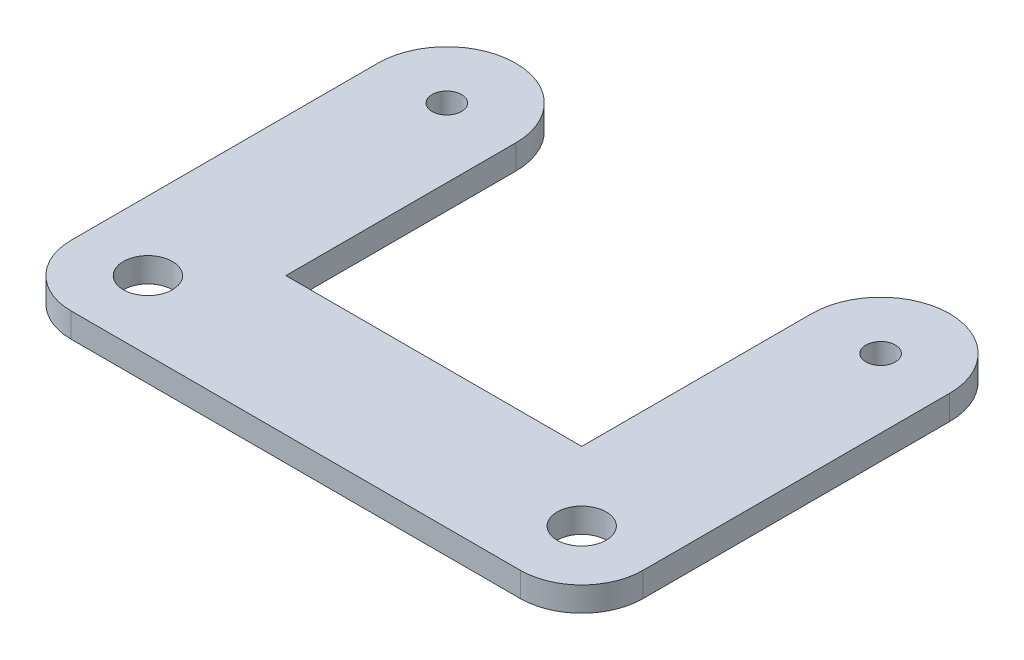
ISO-10303-21;
HEADER;
FILE_DESCRIPTION(('STEP AP214'),'2;1');
FILE_NAME('part.step','',(''),(''),'','','');
FILE_SCHEMA(('AUTOMOTIVE_DESIGN { 1 0 10303 214 1 1 1 1 }'));
ENDSEC;
DATA;
#1=APPLICATION_CONTEXT('core data for automotive mechanical design processes');
#2=APPLICATION_PROTOCOL_DEFINITION('international standard','automotive_design',2000,#1);
#3=PRODUCT_CONTEXT('',#1,'mechanical');
#4=PRODUCT('Part','Part','',(#3));
#5=PRODUCT_RELATED_PRODUCT_CATEGORY('part','',(#4));
#6=PRODUCT_DEFINITION_FORMATION('','',#4);
#7=PRODUCT_DEFINITION_CONTEXT('part definition',#1,'design');
#8=PRODUCT_DEFINITION('design','',#6,#7);
#9=PRODUCT_DEFINITION_SHAPE('','',#8);
#10=(LENGTH_UNIT() NAMED_UNIT(*) SI_UNIT(.MILLI.,.METRE.));
#11=(NAMED_UNIT(*) PLANE_ANGLE_UNIT() SI_UNIT($,.RADIAN.));
#12=(NAMED_UNIT(*) SI_UNIT($,.STERADIAN.) SOLID_ANGLE_UNIT());
#13=UNCERTAINTY_MEASURE_WITH_UNIT(LENGTH_MEASURE(1.E-05),#10,'distance_accuracy_value','');
#14=(GEOMETRIC_REPRESENTATION_CONTEXT(3) GLOBAL_UNCERTAINTY_ASSIGNED_CONTEXT((#13)) GLOBAL_UNIT_ASSIGNED_CONTEXT((#10,
#11,#12)) REPRESENTATION_CONTEXT('',''));
#15=CARTESIAN_POINT('',(0.,0.,0.));
#16=DIRECTION('',(0.,0.,1.));
#17=DIRECTION('',(1.,0.,0.));
#18=AXIS2_PLACEMENT_3D('',#15,#16,#17);
#19=CARTESIAN_POINT('',(46.625,4.,0.));
#20=DIRECTION('',(-1.,0.,0.));
#21=DIRECTION('',(0.,0.,1.));
#22=AXIS2_PLACEMENT_3D('',#19,#20,#21);
#23=PLANE('',#22);
#24=DIRECTION('',(0.,0.,-1.));
#25=VECTOR('',#24,1.);
#26=CARTESIAN_POINT('',(46.625,4.,0.));
#27=LINE('',#26,#25);
#28=CARTESIAN_POINT('',(46.625,4.,50.));
#29=VERTEX_POINT('',#28);
#30=CARTESIAN_POINT('',(46.625,4.,0.));
#31=VERTEX_POINT('',#30);
#32=EDGE_CURVE('E117',#29,#31,#27,.T.);
#33=ORIENTED_EDGE('',*,*,#32,.F.);
#34=DIRECTION('',(0.,-1.,0.));
#35=VECTOR('',#34,1.);
#36=CARTESIAN_POINT('',(46.625,4.,50.));
#37=LINE('',#36,#35);
#38=CARTESIAN_POINT('',(46.625,0.,50.));
#39=VERTEX_POINT('',#38);
#40=EDGE_CURVE('E143',#29,#39,#37,.T.);
#41=ORIENTED_EDGE('',*,*,#40,.T.);
#42=DIRECTION('',(0.,0.,-1.));
#43=VECTOR('',#42,1.);
#44=CARTESIAN_POINT('',(46.625,0.,0.));
#45=LINE('',#44,#43);
#46=CARTESIAN_POINT('',(46.625,0.,0.));
#47=VERTEX_POINT('',#46);
#48=EDGE_CURVE('E141',#39,#47,#45,.T.);
#49=ORIENTED_EDGE('',*,*,#48,.T.);
#50=DIRECTION('',(0.,-1.,0.));
#51=VECTOR('',#50,1.);
#52=CARTESIAN_POINT('',(46.625,4.,0.));
#53=LINE('',#52,#51);
#54=EDGE_CURVE('E135',#31,#47,#53,.T.);
#55=ORIENTED_EDGE('',*,*,#54,.F.);
#56=EDGE_LOOP('',(#33,#41,#49,#55));
#57=FACE_BOUND('',#56,.T.);
#58=ADVANCED_FACE('F39',(#57),#23,.F.);
#59=CARTESIAN_POINT('',(35.375,4.,0.));
#60=DIRECTION('',(0.,-1.,0.));
#61=DIRECTION('',(0.,0.,-1.));
#62=AXIS2_PLACEMENT_3D('',#59,#60,#61);
#63=CYLINDRICAL_SURFACE('',#62,11.25);
#64=CARTESIAN_POINT('',(35.375,0.,0.));
#65=DIRECTION('',(0.,1.,0.));
#66=DIRECTION('',(0.,0.,1.));
#67=AXIS2_PLACEMENT_3D('',#64,#65,#66);
#68=CIRCLE('',#67,11.25);
#69=CARTESIAN_POINT('',(24.125,0.,0.));
#70=VERTEX_POINT('',#69);
#71=EDGE_CURVE('E212',#47,#70,#68,.T.);
#72=ORIENTED_EDGE('',*,*,#71,.T.);
#73=DIRECTION('',(0.,-1.,0.));
#74=VECTOR('',#73,1.);
#75=CARTESIAN_POINT('',(24.125,4.,0.));
#76=LINE('',#75,#74);
#77=CARTESIAN_POINT('',(24.125,4.,0.));
#78=VERTEX_POINT('',#77);
#79=EDGE_CURVE('E136',#78,#70,#76,.T.);
#80=ORIENTED_EDGE('',*,*,#79,.F.);
#81=CARTESIAN_POINT('',(35.375,4.,0.));
#82=DIRECTION('',(0.,1.,0.));
#83=DIRECTION('',(0.,0.,1.));
#84=AXIS2_PLACEMENT_3D('',#81,#82,#83);
#85=CIRCLE('',#84,11.25);
#86=EDGE_CURVE('E122',#31,#78,#85,.T.);
#87=ORIENTED_EDGE('',*,*,#86,.F.);
#88=ORIENTED_EDGE('',*,*,#54,.T.);
#89=EDGE_LOOP('',(#72,#80,#87,#88));
#90=FACE_BOUND('',#89,.T.);
#91=ADVANCED_FACE('F134',(#90),#63,.T.);
#92=CARTESIAN_POINT('',(24.125,4.,0.));
#93=DIRECTION('',(-1.,0.,0.));
#94=DIRECTION('',(0.,0.,1.));
#95=AXIS2_PLACEMENT_3D('',#92,#93,#94);
#96=PLANE('',#95);
#97=DIRECTION('',(0.,0.,-1.));
#98=VECTOR('',#97,1.);
#99=CARTESIAN_POINT('',(24.125,0.,0.));
#100=LINE('',#99,#98);
#101=CARTESIAN_POINT('',(24.125,0.,37.5));
#102=VERTEX_POINT('',#101);
#103=EDGE_CURVE('E210',#102,#70,#100,.T.);
#104=ORIENTED_EDGE('',*,*,#103,.F.);
#105=DIRECTION('',(0.,-1.,0.));
#106=VECTOR('',#105,1.);
#107=CARTESIAN_POINT('',(24.125,4.,37.5));
#108=LINE('',#107,#106);
#109=CARTESIAN_POINT('',(24.125,4.,37.5));
#110=VERTEX_POINT('',#109);
#111=EDGE_CURVE('E147',#110,#102,#108,.T.);
#112=ORIENTED_EDGE('',*,*,#111,.F.);
#113=DIRECTION('',(0.,0.,-1.));
#114=VECTOR('',#113,1.);
#115=CARTESIAN_POINT('',(24.125,4.,0.));
#116=LINE('',#115,#114);
#117=EDGE_CURVE('E138',#110,#78,#116,.T.);
#118=ORIENTED_EDGE('',*,*,#117,.T.);
#119=ORIENTED_EDGE('',*,*,#79,.T.);
#120=EDGE_LOOP('',(#104,#112,#118,#119));
#121=FACE_BOUND('',#120,.T.);
#122=ADVANCED_FACE('F211',(#121),#96,.T.);
#123=CARTESIAN_POINT('',(0.,4.,37.5));
#124=DIRECTION('',(0.,0.,-1.));
#125=DIRECTION('',(-1.,0.,0.));
#126=AXIS2_PLACEMENT_3D('',#123,#124,#125);
#127=PLANE('',#126);
#128=DIRECTION('',(1.,0.,0.));
#129=VECTOR('',#128,1.);
#130=CARTESIAN_POINT('',(0.,0.,37.5));
#131=LINE('',#130,#129);
#132=CARTESIAN_POINT('',(-24.125,0.,37.5));
#133=VERTEX_POINT('',#132);
#134=EDGE_CURVE('E204',#133,#102,#131,.T.);
#135=ORIENTED_EDGE('',*,*,#134,.F.);
#136=DIRECTION('',(0.,-1.,0.));
#137=VECTOR('',#136,1.);
#138=CARTESIAN_POINT('',(-24.125,4.,37.5));
#139=LINE('',#138,#137);
#140=CARTESIAN_POINT('',(-24.125,4.,37.5));
#141=VERTEX_POINT('',#140);
#142=EDGE_CURVE('E197',#141,#133,#139,.T.);
#143=ORIENTED_EDGE('',*,*,#142,.F.);
#144=DIRECTION('',(1.,0.,0.));
#145=VECTOR('',#144,1.);
#146=CARTESIAN_POINT('',(0.,4.,37.5));
#147=LINE('',#146,#145);
#148=EDGE_CURVE('E207',#141,#110,#147,.T.);
#149=ORIENTED_EDGE('',*,*,#148,.T.);
#150=ORIENTED_EDGE('',*,*,#111,.T.);
#151=EDGE_LOOP('',(#135,#143,#149,#150));
#152=FACE_BOUND('',#151,.T.);
#153=ADVANCED_FACE('F202',(#152),#127,.T.);
#154=CARTESIAN_POINT('',(-24.125,4.,0.));
#155=DIRECTION('',(1.,0.,0.));
#156=DIRECTION('',(0.,0.,-1.));
#157=AXIS2_PLACEMENT_3D('',#154,#155,#156);
#158=PLANE('',#157);
#159=DIRECTION('',(0.,0.,1.));
#160=VECTOR('',#159,1.);
#161=CARTESIAN_POINT('',(-24.125,0.,0.));
#162=LINE('',#161,#160);
#163=CARTESIAN_POINT('',(-24.125,0.,0.));
#164=VERTEX_POINT('',#163);
#165=EDGE_CURVE('E183',#164,#133,#162,.T.);
#166=ORIENTED_EDGE('',*,*,#165,.F.);
#167=DIRECTION('',(0.,-1.,0.));
#168=VECTOR('',#167,1.);
#169=CARTESIAN_POINT('',(-24.125,4.,0.));
#170=LINE('',#169,#168);
#171=CARTESIAN_POINT('',(-24.125,4.,0.));
#172=VERTEX_POINT('',#171);
#173=EDGE_CURVE('E194',#172,#164,#170,.T.);
#174=ORIENTED_EDGE('',*,*,#173,.F.);
#175=DIRECTION('',(0.,0.,1.));
#176=VECTOR('',#175,1.);
#177=CARTESIAN_POINT('',(-24.125,4.,0.));
#178=LINE('',#177,#176);
#179=EDGE_CURVE('E232',#172,#141,#178,.T.);
#180=ORIENTED_EDGE('',*,*,#179,.T.);
#181=ORIENTED_EDGE('',*,*,#142,.T.);
#182=EDGE_LOOP('',(#166,#174,#180,#181));
#183=FACE_BOUND('',#182,.T.);
#184=ADVANCED_FACE('F294',(#183),#158,.T.);
#185=CARTESIAN_POINT('',(-35.375,4.,0.));
#186=DIRECTION('',(0.,-1.,0.));
#187=DIRECTION('',(0.,0.,-1.));
#188=AXIS2_PLACEMENT_3D('',#185,#186,#187);
#189=CYLINDRICAL_SURFACE('',#188,11.25);
#190=CARTESIAN_POINT('',(-35.375,0.,0.));
#191=DIRECTION('',(0.,1.,0.));
#192=DIRECTION('',(0.,0.,1.));
#193=AXIS2_PLACEMENT_3D('',#190,#191,#192);
#194=CIRCLE('',#193,11.25);
#195=CARTESIAN_POINT('',(-46.625,0.,0.));
#196=VERTEX_POINT('',#195);
#197=EDGE_CURVE('E179',#164,#196,#194,.T.);
#198=ORIENTED_EDGE('',*,*,#197,.T.);
#199=DIRECTION('',(0.,-1.,0.));
#200=VECTOR('',#199,1.);
#201=CARTESIAN_POINT('',(-46.625,4.,0.));
#202=LINE('',#201,#200);
#203=CARTESIAN_POINT('',(-46.625,4.,0.));
#204=VERTEX_POINT('',#203);
#205=EDGE_CURVE('E178',#204,#196,#202,.T.);
#206=ORIENTED_EDGE('',*,*,#205,.F.);
#207=CARTESIAN_POINT('',(-35.375,4.,0.));
#208=DIRECTION('',(0.,1.,0.));
#209=DIRECTION('',(0.,0.,1.));
#210=AXIS2_PLACEMENT_3D('',#207,#208,#209);
#211=CIRCLE('',#210,11.25);
#212=EDGE_CURVE('E230',#172,#204,#211,.T.);
#213=ORIENTED_EDGE('',*,*,#212,.F.);
#214=ORIENTED_EDGE('',*,*,#173,.T.);
#215=EDGE_LOOP('',(#198,#206,#213,#214));
#216=FACE_BOUND('',#215,.T.);
#217=ADVANCED_FACE('F291',(#216),#189,.T.);
#218=CARTESIAN_POINT('',(-46.625,4.,0.));
#219=DIRECTION('',(1.,0.,0.));
#220=DIRECTION('',(0.,0.,-1.));
#221=AXIS2_PLACEMENT_3D('',#218,#219,#220);
#222=PLANE('',#221);
#223=DIRECTION('',(0.,0.,1.));
#224=VECTOR('',#223,1.);
#225=CARTESIAN_POINT('',(-46.625,0.,0.));
#226=LINE('',#225,#224);
#227=CARTESIAN_POINT('',(-46.625,0.,50.));
#228=VERTEX_POINT('',#227);
#229=EDGE_CURVE('E173',#196,#228,#226,.T.);
#230=ORIENTED_EDGE('',*,*,#229,.T.);
#231=DIRECTION('',(0.,-1.,0.));
#232=VECTOR('',#231,1.);
#233=CARTESIAN_POINT('',(-46.625,4.,50.));
#234=LINE('',#233,#232);
#235=CARTESIAN_POINT('',(-46.625,4.,50.));
#236=VERTEX_POINT('',#235);
#237=EDGE_CURVE('E11',#228,#236,#234,.F.);
#238=ORIENTED_EDGE('',*,*,#237,.T.);
#239=DIRECTION('',(0.,0.,1.));
#240=VECTOR('',#239,1.);
#241=CARTESIAN_POINT('',(-46.625,4.,0.));
#242=LINE('',#241,#240);
#243=EDGE_CURVE('E161',#204,#236,#242,.T.);
#244=ORIENTED_EDGE('',*,*,#243,.F.);
#245=ORIENTED_EDGE('',*,*,#205,.T.);
#246=EDGE_LOOP('',(#230,#238,#244,#245));
#247=FACE_BOUND('',#246,.T.);
#248=ADVANCED_FACE('F176',(#247),#222,.F.);
#249=CARTESIAN_POINT('',(-35.375,4.,0.));
#250=DIRECTION('',(0.,-1.,0.));
#251=DIRECTION('',(0.,0.,-1.));
#252=AXIS2_PLACEMENT_3D('',#249,#250,#251);
#253=CYLINDRICAL_SURFACE('',#252,2.4);
#254=CARTESIAN_POINT('',(-35.375,4.,0.));
#255=DIRECTION('',(0.,1.,0.));
#256=DIRECTION('',(0.,0.,1.));
#257=AXIS2_PLACEMENT_3D('',#254,#255,#256);
#258=CIRCLE('',#257,2.4);
#259=CARTESIAN_POINT('',(-35.375,4.,2.40000000000001));
#260=VERTEX_POINT('',#259);
#261=EDGE_CURVE('E166',#260,#260,#258,.T.);
#262=ORIENTED_EDGE('',*,*,#261,.T.);
#263=EDGE_LOOP('',(#262));
#264=FACE_BOUND('',#263,.T.);
#265=CARTESIAN_POINT('',(-35.375,0.,0.));
#266=DIRECTION('',(0.,1.,0.));
#267=DIRECTION('',(0.,0.,1.));
#268=AXIS2_PLACEMENT_3D('',#265,#266,#267);
#269=CIRCLE('',#268,2.4);
#270=CARTESIAN_POINT('',(-35.375,0.,2.40000000000001));
#271=VERTEX_POINT('',#270);
#272=EDGE_CURVE('E181',#271,#271,#269,.T.);
#273=ORIENTED_EDGE('',*,*,#272,.F.);
#274=EDGE_LOOP('',(#273));
#275=FACE_BOUND('',#274,.T.);
#276=ADVANCED_FACE('F283',(#264,#275),#253,.F.);
#277=CARTESIAN_POINT('',(0.,4.,60.));
#278=DIRECTION('',(0.,0.,-1.));
#279=DIRECTION('',(-1.,0.,0.));
#280=AXIS2_PLACEMENT_3D('',#277,#278,#279);
#281=PLANE('',#280);
#282=DIRECTION('',(1.,0.,0.));
#283=VECTOR('',#282,1.);
#284=CARTESIAN_POINT('',(0.,0.,60.));
#285=LINE('',#284,#283);
#286=CARTESIAN_POINT('',(-36.625,0.,60.));
#287=VERTEX_POINT('',#286);
#288=CARTESIAN_POINT('',(36.625,0.,60.));
#289=VERTEX_POINT('',#288);
#290=EDGE_CURVE('E174',#287,#289,#285,.T.);
#291=ORIENTED_EDGE('',*,*,#290,.T.);
#292=DIRECTION('',(0.,-1.,0.));
#293=VECTOR('',#292,1.);
#294=CARTESIAN_POINT('',(36.625,4.,60.));
#295=LINE('',#294,#293);
#296=CARTESIAN_POINT('',(36.625,4.,60.));
#297=VERTEX_POINT('',#296);
#298=EDGE_CURVE('E60',#289,#297,#295,.F.);
#299=ORIENTED_EDGE('',*,*,#298,.T.);
#300=DIRECTION('',(1.,0.,0.));
#301=VECTOR('',#300,1.);
#302=CARTESIAN_POINT('',(0.,4.,60.));
#303=LINE('',#302,#301);
#304=CARTESIAN_POINT('',(-36.625,4.,60.));
#305=VERTEX_POINT('',#304);
#306=EDGE_CURVE('E160',#305,#297,#303,.T.);
#307=ORIENTED_EDGE('',*,*,#306,.F.);
#308=DIRECTION('',(0.,-1.,0.));
#309=VECTOR('',#308,1.);
#310=CARTESIAN_POINT('',(-36.625,4.,60.));
#311=LINE('',#310,#309);
#312=EDGE_CURVE('E154',#305,#287,#311,.T.);
#313=ORIENTED_EDGE('',*,*,#312,.T.);
#314=EDGE_LOOP('',(#291,#299,#307,#313));
#315=FACE_BOUND('',#314,.T.);
#316=ADVANCED_FACE('F164',(#315),#281,.F.);
#317=CARTESIAN_POINT('',(-35.375,4.,48.75));
#318=DIRECTION('',(0.,-1.,0.));
#319=DIRECTION('',(0.,0.,-1.));
#320=AXIS2_PLACEMENT_3D('',#317,#318,#319);
#321=CYLINDRICAL_SURFACE('',#320,4.);
#322=CARTESIAN_POINT('',(-35.375,4.,48.75));
#323=DIRECTION('',(0.,1.,0.));
#324=DIRECTION('',(0.,0.,1.));
#325=AXIS2_PLACEMENT_3D('',#322,#323,#324);
#326=CIRCLE('',#325,4.);
#327=CARTESIAN_POINT('',(-35.375,4.,52.75));
#328=VERTEX_POINT('',#327);
#329=EDGE_CURVE('E129',#328,#328,#326,.T.);
#330=ORIENTED_EDGE('',*,*,#329,.T.);
#331=EDGE_LOOP('',(#330));
#332=FACE_BOUND('',#331,.T.);
#333=CARTESIAN_POINT('',(-35.375,0.,48.75));
#334=DIRECTION('',(0.,1.,0.));
#335=DIRECTION('',(0.,0.,1.));
#336=AXIS2_PLACEMENT_3D('',#333,#334,#335);
#337=CIRCLE('',#336,4.);
#338=CARTESIAN_POINT('',(-35.375,0.,52.75));
#339=VERTEX_POINT('',#338);
#340=EDGE_CURVE('E219',#339,#339,#337,.T.);
#341=ORIENTED_EDGE('',*,*,#340,.F.);
#342=EDGE_LOOP('',(#341));
#343=FACE_BOUND('',#342,.T.);
#344=ADVANCED_FACE('F251',(#332,#343),#321,.F.);
#345=CARTESIAN_POINT('',(35.375,4.,48.75));
#346=DIRECTION('',(0.,-1.,0.));
#347=DIRECTION('',(0.,0.,-1.));
#348=AXIS2_PLACEMENT_3D('',#345,#346,#347);
#349=CYLINDRICAL_SURFACE('',#348,4.);
#350=CARTESIAN_POINT('',(35.375,4.,48.75));
#351=DIRECTION('',(0.,1.,0.));
#352=DIRECTION('',(0.,0.,1.));
#353=AXIS2_PLACEMENT_3D('',#350,#351,#352);
#354=CIRCLE('',#353,4.);
#355=CARTESIAN_POINT('',(35.375,4.,52.75));
#356=VERTEX_POINT('',#355);
#357=EDGE_CURVE('E192',#356,#356,#354,.T.);
#358=ORIENTED_EDGE('',*,*,#357,.T.);
#359=EDGE_LOOP('',(#358));
#360=FACE_BOUND('',#359,.T.);
#361=CARTESIAN_POINT('',(35.375,0.,48.75));
#362=DIRECTION('',(0.,1.,0.));
#363=DIRECTION('',(0.,0.,1.));
#364=AXIS2_PLACEMENT_3D('',#361,#362,#363);
#365=CIRCLE('',#364,4.);
#366=CARTESIAN_POINT('',(35.375,0.,52.75));
#367=VERTEX_POINT('',#366);
#368=EDGE_CURVE('E222',#367,#367,#365,.T.);
#369=ORIENTED_EDGE('',*,*,#368,.F.);
#370=EDGE_LOOP('',(#369));
#371=FACE_BOUND('',#370,.T.);
#372=ADVANCED_FACE('F242',(#360,#371),#349,.F.);
#373=CARTESIAN_POINT('',(35.375,4.,0.));
#374=DIRECTION('',(0.,-1.,0.));
#375=DIRECTION('',(0.,0.,-1.));
#376=AXIS2_PLACEMENT_3D('',#373,#374,#375);
#377=CYLINDRICAL_SURFACE('',#376,2.4);
#378=CARTESIAN_POINT('',(35.375,4.,0.));
#379=DIRECTION('',(0.,1.,0.));
#380=DIRECTION('',(0.,0.,1.));
#381=AXIS2_PLACEMENT_3D('',#378,#379,#380);
#382=CIRCLE('',#381,2.4);
#383=CARTESIAN_POINT('',(35.375,4.,2.40000000000001));
#384=VERTEX_POINT('',#383);
#385=EDGE_CURVE('E195',#384,#384,#382,.T.);
#386=ORIENTED_EDGE('',*,*,#385,.T.);
#387=EDGE_LOOP('',(#386));
#388=FACE_BOUND('',#387,.T.);
#389=CARTESIAN_POINT('',(35.375,0.,0.));
#390=DIRECTION('',(0.,1.,0.));
#391=DIRECTION('',(0.,0.,1.));
#392=AXIS2_PLACEMENT_3D('',#389,#390,#391);
#393=CIRCLE('',#392,2.4);
#394=CARTESIAN_POINT('',(35.375,0.,2.40000000000001));
#395=VERTEX_POINT('',#394);
#396=EDGE_CURVE('E189',#395,#395,#393,.T.);
#397=ORIENTED_EDGE('',*,*,#396,.F.);
#398=EDGE_LOOP('',(#397));
#399=FACE_BOUND('',#398,.T.);
#400=ADVANCED_FACE('F247',(#388,#399),#377,.F.);
#401=CARTESIAN_POINT('',(0.,4.,0.));
#402=DIRECTION('',(0.,1.,0.));
#403=DIRECTION('',(0.,0.,1.));
#404=AXIS2_PLACEMENT_3D('',#401,#402,#403);
#405=PLANE('',#404);
#406=ORIENTED_EDGE('',*,*,#357,.F.);
#407=EDGE_LOOP('',(#406));
#408=FACE_BOUND('',#407,.T.);
#409=ORIENTED_EDGE('',*,*,#329,.F.);
#410=EDGE_LOOP('',(#409));
#411=FACE_BOUND('',#410,.T.);
#412=ORIENTED_EDGE('',*,*,#306,.T.);
#413=CARTESIAN_POINT('',(36.625,4.,50.));
#414=DIRECTION('',(0.,1.,0.));
#415=DIRECTION('',(0.,0.,1.));
#416=AXIS2_PLACEMENT_3D('',#413,#414,#415);
#417=CIRCLE('',#416,10.);
#418=EDGE_CURVE('E47',#297,#29,#417,.T.);
#419=ORIENTED_EDGE('',*,*,#418,.T.);
#420=ORIENTED_EDGE('',*,*,#32,.T.);
#421=ORIENTED_EDGE('',*,*,#86,.T.);
#422=ORIENTED_EDGE('',*,*,#117,.F.);
#423=ORIENTED_EDGE('',*,*,#148,.F.);
#424=ORIENTED_EDGE('',*,*,#179,.F.);
#425=ORIENTED_EDGE('',*,*,#212,.T.);
#426=ORIENTED_EDGE('',*,*,#243,.T.);
#427=CARTESIAN_POINT('',(-36.625,4.,50.));
#428=DIRECTION('',(0.,1.,0.));
#429=DIRECTION('',(0.,0.,1.));
#430=AXIS2_PLACEMENT_3D('',#427,#428,#429);
#431=CIRCLE('',#430,10.);
#432=EDGE_CURVE('E158',#236,#305,#431,.T.);
#433=ORIENTED_EDGE('',*,*,#432,.T.);
#434=EDGE_LOOP('',(#412,#419,#420,#421,#422,#423,#424,#425,#426,#433));
#435=FACE_BOUND('',#434,.T.);
#436=ORIENTED_EDGE('',*,*,#261,.F.);
#437=EDGE_LOOP('',(#436));
#438=FACE_BOUND('',#437,.T.);
#439=ORIENTED_EDGE('',*,*,#385,.F.);
#440=EDGE_LOOP('',(#439));
#441=FACE_BOUND('',#440,.T.);
#442=ADVANCED_FACE('F119',(#408,#411,#435,#438,#441),#405,.T.);
#443=CARTESIAN_POINT('',(0.,0.,0.));
#444=DIRECTION('',(0.,1.,0.));
#445=DIRECTION('',(0.,0.,1.));
#446=AXIS2_PLACEMENT_3D('',#443,#444,#445);
#447=PLANE('',#446);
#448=ORIENTED_EDGE('',*,*,#368,.T.);
#449=EDGE_LOOP('',(#448));
#450=FACE_BOUND('',#449,.T.);
#451=ORIENTED_EDGE('',*,*,#340,.T.);
#452=EDGE_LOOP('',(#451));
#453=FACE_BOUND('',#452,.T.);
#454=ORIENTED_EDGE('',*,*,#48,.F.);
#455=CARTESIAN_POINT('',(36.625,0.,50.));
#456=DIRECTION('',(0.,1.,0.));
#457=DIRECTION('',(0.,0.,1.));
#458=AXIS2_PLACEMENT_3D('',#455,#456,#457);
#459=CIRCLE('',#458,10.);
#460=EDGE_CURVE('E152',#39,#289,#459,.F.);
#461=ORIENTED_EDGE('',*,*,#460,.T.);
#462=ORIENTED_EDGE('',*,*,#290,.F.);
#463=CARTESIAN_POINT('',(-36.625,0.,50.));
#464=DIRECTION('',(0.,1.,0.));
#465=DIRECTION('',(0.,0.,1.));
#466=AXIS2_PLACEMENT_3D('',#463,#464,#465);
#467=CIRCLE('',#466,10.);
#468=EDGE_CURVE('E145',#287,#228,#467,.F.);
#469=ORIENTED_EDGE('',*,*,#468,.T.);
#470=ORIENTED_EDGE('',*,*,#229,.F.);
#471=ORIENTED_EDGE('',*,*,#197,.F.);
#472=ORIENTED_EDGE('',*,*,#165,.T.);
#473=ORIENTED_EDGE('',*,*,#134,.T.);
#474=ORIENTED_EDGE('',*,*,#103,.T.);
#475=ORIENTED_EDGE('',*,*,#71,.F.);
#476=EDGE_LOOP('',(#454,#461,#462,#469,#470,#471,#472,#473,#474,#475));
#477=FACE_BOUND('',#476,.T.);
#478=ORIENTED_EDGE('',*,*,#272,.T.);
#479=EDGE_LOOP('',(#478));
#480=FACE_BOUND('',#479,.T.);
#481=ORIENTED_EDGE('',*,*,#396,.T.);
#482=EDGE_LOOP('',(#481));
#483=FACE_BOUND('',#482,.T.);
#484=ADVANCED_FACE('F170',(#450,#453,#477,#480,#483),#447,.F.);
#485=CARTESIAN_POINT('',(36.625,4.,50.));
#486=DIRECTION('',(0.,-1.,0.));
#487=DIRECTION('',(0.,0.,-1.));
#488=AXIS2_PLACEMENT_3D('',#485,#486,#487);
#489=CYLINDRICAL_SURFACE('',#488,10.);
#490=ORIENTED_EDGE('',*,*,#418,.F.);
#491=ORIENTED_EDGE('',*,*,#298,.F.);
#492=ORIENTED_EDGE('',*,*,#460,.F.);
#493=ORIENTED_EDGE('',*,*,#40,.F.);
#494=EDGE_LOOP('',(#490,#491,#492,#493));
#495=FACE_BOUND('',#494,.T.);
#496=ADVANCED_FACE('F258',(#495),#489,.T.);
#497=CARTESIAN_POINT('',(-36.625,4.,50.));
#498=DIRECTION('',(0.,-1.,0.));
#499=DIRECTION('',(0.,0.,-1.));
#500=AXIS2_PLACEMENT_3D('',#497,#498,#499);
#501=CYLINDRICAL_SURFACE('',#500,10.);
#502=ORIENTED_EDGE('',*,*,#432,.F.);
#503=ORIENTED_EDGE('',*,*,#237,.F.);
#504=ORIENTED_EDGE('',*,*,#468,.F.);
#505=ORIENTED_EDGE('',*,*,#312,.F.);
#506=EDGE_LOOP('',(#502,#503,#504,#505));
#507=FACE_BOUND('',#506,.T.);
#508=ADVANCED_FACE('F41',(#507),#501,.T.);
#509=CLOSED_SHELL('',(#58,#91,#122,#153,#184,#217,#248,#276,#316,#344,#372,#400,#442,#484,#496,#508));
#510=MANIFOLD_SOLID_BREP('B2',#509);
#511=ADVANCED_BREP_SHAPE_REPRESENTATION('',(#18,#510),#14);
#512=SHAPE_DEFINITION_REPRESENTATION(#9,#511);
ENDSEC;
END-ISO-10303-21;
